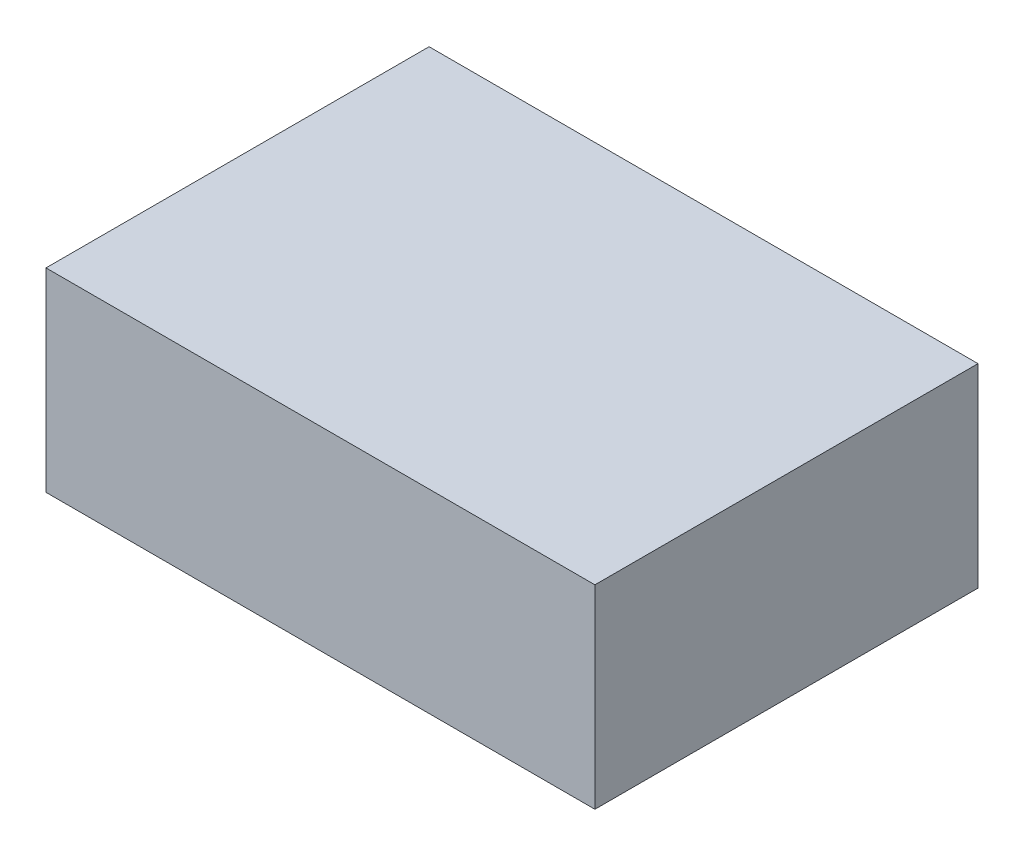
ISO-10303-21;
HEADER;
FILE_DESCRIPTION(('STEP AP214'),'2;1');
FILE_NAME('part.step','',(''),(''),'','','');
FILE_SCHEMA(('AUTOMOTIVE_DESIGN { 1 0 10303 214 1 1 1 1 }'));
ENDSEC;
DATA;
#1=APPLICATION_CONTEXT('core data for automotive mechanical design processes');
#2=APPLICATION_PROTOCOL_DEFINITION('international standard','automotive_design',2000,#1);
#3=PRODUCT_CONTEXT('',#1,'mechanical');
#4=PRODUCT('Part','Part','',(#3));
#5=PRODUCT_RELATED_PRODUCT_CATEGORY('part','',(#4));
#6=PRODUCT_DEFINITION_FORMATION('','',#4);
#7=PRODUCT_DEFINITION_CONTEXT('part definition',#1,'design');
#8=PRODUCT_DEFINITION('design','',#6,#7);
#9=PRODUCT_DEFINITION_SHAPE('','',#8);
#10=(LENGTH_UNIT() NAMED_UNIT(*) SI_UNIT(.MILLI.,.METRE.));
#11=(NAMED_UNIT(*) PLANE_ANGLE_UNIT() SI_UNIT($,.RADIAN.));
#12=(NAMED_UNIT(*) SI_UNIT($,.STERADIAN.) SOLID_ANGLE_UNIT());
#13=UNCERTAINTY_MEASURE_WITH_UNIT(LENGTH_MEASURE(1.E-05),#10,'distance_accuracy_value','');
#14=(GEOMETRIC_REPRESENTATION_CONTEXT(3) GLOBAL_UNCERTAINTY_ASSIGNED_CONTEXT((#13)) GLOBAL_UNIT_ASSIGNED_CONTEXT((#10,
#11,#12)) REPRESENTATION_CONTEXT('',''));
#15=CARTESIAN_POINT('',(0.,0.,0.));
#16=DIRECTION('',(0.,0.,1.));
#17=DIRECTION('',(1.,0.,0.));
#18=AXIS2_PLACEMENT_3D('',#15,#16,#17);
#19=CARTESIAN_POINT('',(48.,34.,33.5));
#20=DIRECTION('',(-1.,0.,0.));
#21=DIRECTION('',(0.,0.,1.));
#22=AXIS2_PLACEMENT_3D('',#19,#20,#21);
#23=PLANE('',#22);
#24=DIRECTION('',(0.,0.,-1.));
#25=VECTOR('',#24,1.);
#26=CARTESIAN_POINT('',(48.,0.,33.5));
#27=LINE('',#26,#25);
#28=CARTESIAN_POINT('',(48.,0.,33.5));
#29=VERTEX_POINT('',#28);
#30=CARTESIAN_POINT('',(48.,0.,-33.5));
#31=VERTEX_POINT('',#30);
#32=EDGE_CURVE('E96',#29,#31,#27,.T.);
#33=ORIENTED_EDGE('',*,*,#32,.T.);
#34=DIRECTION('',(0.,-1.,0.));
#35=VECTOR('',#34,1.);
#36=CARTESIAN_POINT('',(48.,34.,-33.5));
#37=LINE('',#36,#35);
#38=CARTESIAN_POINT('',(48.,34.,-33.5));
#39=VERTEX_POINT('',#38);
#40=EDGE_CURVE('E11',#39,#31,#37,.T.);
#41=ORIENTED_EDGE('',*,*,#40,.F.);
#42=DIRECTION('',(0.,0.,-1.));
#43=VECTOR('',#42,1.);
#44=CARTESIAN_POINT('',(48.,34.,33.5));
#45=LINE('',#44,#43);
#46=CARTESIAN_POINT('',(48.,34.,33.5));
#47=VERTEX_POINT('',#46);
#48=EDGE_CURVE('E84',#47,#39,#45,.T.);
#49=ORIENTED_EDGE('',*,*,#48,.F.);
#50=DIRECTION('',(0.,-1.,0.));
#51=VECTOR('',#50,1.);
#52=CARTESIAN_POINT('',(48.,34.,33.5));
#53=LINE('',#52,#51);
#54=EDGE_CURVE('E92',#47,#29,#53,.T.);
#55=ORIENTED_EDGE('',*,*,#54,.T.);
#56=EDGE_LOOP('',(#33,#41,#49,#55));
#57=FACE_BOUND('',#56,.T.);
#58=ADVANCED_FACE('F33',(#57),#23,.F.);
#59=CARTESIAN_POINT('',(-48.,34.,-33.5));
#60=DIRECTION('',(0.,0.,1.));
#61=DIRECTION('',(1.,0.,0.));
#62=AXIS2_PLACEMENT_3D('',#59,#60,#61);
#63=PLANE('',#62);
#64=DIRECTION('',(-1.,0.,0.));
#65=VECTOR('',#64,1.);
#66=CARTESIAN_POINT('',(-48.,0.,-33.5));
#67=LINE('',#66,#65);
#68=CARTESIAN_POINT('',(-48.,0.,-33.5));
#69=VERTEX_POINT('',#68);
#70=EDGE_CURVE('E88',#31,#69,#67,.T.);
#71=ORIENTED_EDGE('',*,*,#70,.T.);
#72=DIRECTION('',(0.,-1.,0.));
#73=VECTOR('',#72,1.);
#74=CARTESIAN_POINT('',(-48.,34.,-33.5));
#75=LINE('',#74,#73);
#76=CARTESIAN_POINT('',(-48.,34.,-33.5));
#77=VERTEX_POINT('',#76);
#78=EDGE_CURVE('E41',#77,#69,#75,.T.);
#79=ORIENTED_EDGE('',*,*,#78,.F.);
#80=DIRECTION('',(-1.,0.,0.));
#81=VECTOR('',#80,1.);
#82=CARTESIAN_POINT('',(-48.,34.,-33.5));
#83=LINE('',#82,#81);
#84=EDGE_CURVE('E79',#39,#77,#83,.T.);
#85=ORIENTED_EDGE('',*,*,#84,.F.);
#86=ORIENTED_EDGE('',*,*,#40,.T.);
#87=EDGE_LOOP('',(#71,#79,#85,#86));
#88=FACE_BOUND('',#87,.T.);
#89=ADVANCED_FACE('F87',(#88),#63,.F.);
#90=CARTESIAN_POINT('',(-48.,34.,33.5));
#91=DIRECTION('',(1.,0.,0.));
#92=DIRECTION('',(0.,0.,-1.));
#93=AXIS2_PLACEMENT_3D('',#90,#91,#92);
#94=PLANE('',#93);
#95=DIRECTION('',(0.,0.,1.));
#96=VECTOR('',#95,1.);
#97=CARTESIAN_POINT('',(-48.,0.,33.5));
#98=LINE('',#97,#96);
#99=CARTESIAN_POINT('',(-48.,0.,33.5));
#100=VERTEX_POINT('',#99);
#101=EDGE_CURVE('E66',#69,#100,#98,.T.);
#102=ORIENTED_EDGE('',*,*,#101,.T.);
#103=DIRECTION('',(0.,-1.,0.));
#104=VECTOR('',#103,1.);
#105=CARTESIAN_POINT('',(-48.,34.,33.5));
#106=LINE('',#105,#104);
#107=CARTESIAN_POINT('',(-48.,34.,33.5));
#108=VERTEX_POINT('',#107);
#109=EDGE_CURVE('E89',#108,#100,#106,.T.);
#110=ORIENTED_EDGE('',*,*,#109,.F.);
#111=DIRECTION('',(0.,0.,1.));
#112=VECTOR('',#111,1.);
#113=CARTESIAN_POINT('',(-48.,34.,33.5));
#114=LINE('',#113,#112);
#115=EDGE_CURVE('E82',#77,#108,#114,.T.);
#116=ORIENTED_EDGE('',*,*,#115,.F.);
#117=ORIENTED_EDGE('',*,*,#78,.T.);
#118=EDGE_LOOP('',(#102,#110,#116,#117));
#119=FACE_BOUND('',#118,.T.);
#120=ADVANCED_FACE('F90',(#119),#94,.F.);
#121=CARTESIAN_POINT('',(-48.,34.,33.5));
#122=DIRECTION('',(0.,0.,-1.));
#123=DIRECTION('',(-1.,0.,0.));
#124=AXIS2_PLACEMENT_3D('',#121,#122,#123);
#125=PLANE('',#124);
#126=DIRECTION('',(1.,0.,0.));
#127=VECTOR('',#126,1.);
#128=CARTESIAN_POINT('',(-48.,0.,33.5));
#129=LINE('',#128,#127);
#130=EDGE_CURVE('E72',#100,#29,#129,.T.);
#131=ORIENTED_EDGE('',*,*,#130,.T.);
#132=ORIENTED_EDGE('',*,*,#54,.F.);
#133=DIRECTION('',(1.,0.,0.));
#134=VECTOR('',#133,1.);
#135=CARTESIAN_POINT('',(-48.,34.,33.5));
#136=LINE('',#135,#134);
#137=EDGE_CURVE('E49',#108,#47,#136,.T.);
#138=ORIENTED_EDGE('',*,*,#137,.F.);
#139=ORIENTED_EDGE('',*,*,#109,.T.);
#140=EDGE_LOOP('',(#131,#132,#138,#139));
#141=FACE_BOUND('',#140,.T.);
#142=ADVANCED_FACE('F103',(#141),#125,.F.);
#143=CARTESIAN_POINT('',(0.,34.,0.));
#144=DIRECTION('',(0.,-1.,0.));
#145=DIRECTION('',(0.,0.,-1.));
#146=AXIS2_PLACEMENT_3D('',#143,#144,#145);
#147=PLANE('',#146);
#148=ORIENTED_EDGE('',*,*,#48,.T.);
#149=ORIENTED_EDGE('',*,*,#84,.T.);
#150=ORIENTED_EDGE('',*,*,#115,.T.);
#151=ORIENTED_EDGE('',*,*,#137,.T.);
#152=EDGE_LOOP('',(#148,#149,#150,#151));
#153=FACE_BOUND('',#152,.T.);
#154=ADVANCED_FACE('F80',(#153),#147,.F.);
#155=CARTESIAN_POINT('',(0.,0.,0.));
#156=DIRECTION('',(0.,-1.,0.));
#157=DIRECTION('',(0.,0.,-1.));
#158=AXIS2_PLACEMENT_3D('',#155,#156,#157);
#159=PLANE('',#158);
#160=ORIENTED_EDGE('',*,*,#32,.F.);
#161=ORIENTED_EDGE('',*,*,#130,.F.);
#162=ORIENTED_EDGE('',*,*,#101,.F.);
#163=ORIENTED_EDGE('',*,*,#70,.F.);
#164=EDGE_LOOP('',(#160,#161,#162,#163));
#165=FACE_BOUND('',#164,.T.);
#166=ADVANCED_FACE('F106',(#165),#159,.T.);
#167=CLOSED_SHELL('',(#58,#89,#120,#142,#154,#166));
#168=MANIFOLD_SOLID_BREP('B2',#167);
#169=ADVANCED_BREP_SHAPE_REPRESENTATION('',(#18,#168),#14);
#170=SHAPE_DEFINITION_REPRESENTATION(#9,#169);
ENDSEC;
END-ISO-10303-21;
